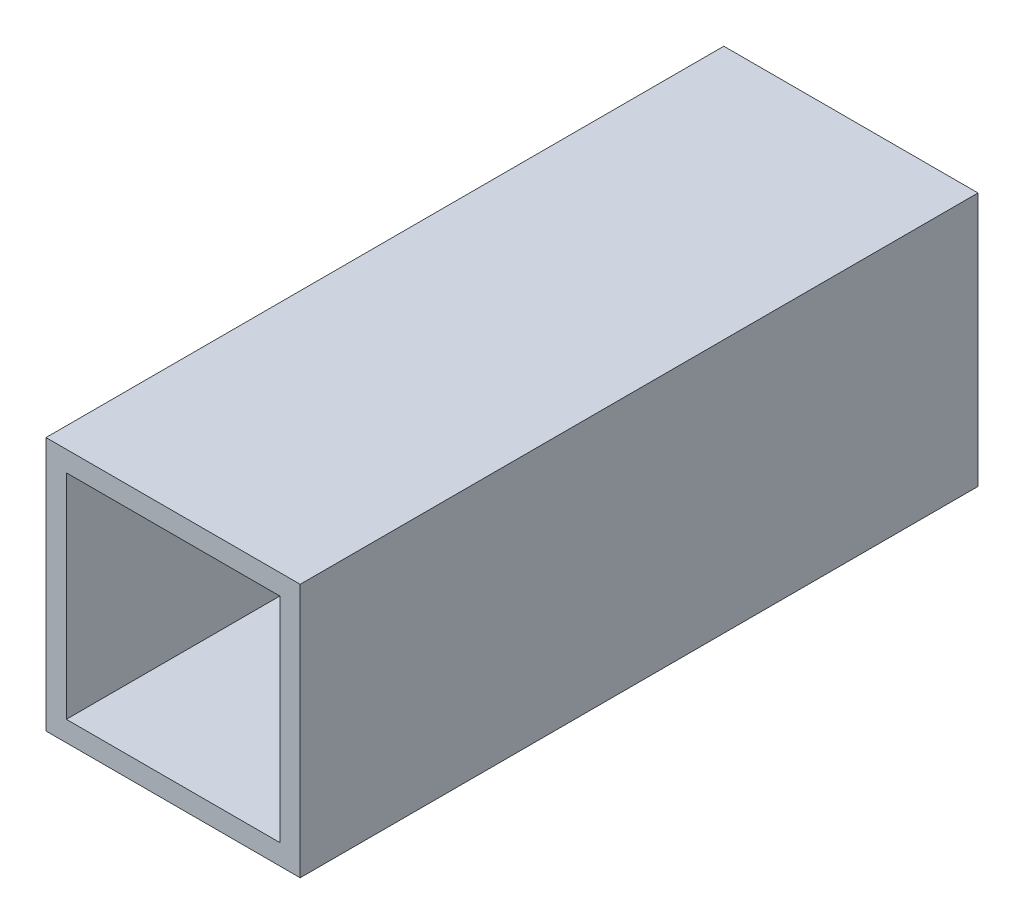
ISO-10303-21;
HEADER;
FILE_DESCRIPTION(('STEP AP214'),'2;1');
FILE_NAME('part.step','',(''),(''),'','','');
FILE_SCHEMA(('AUTOMOTIVE_DESIGN { 1 0 10303 214 1 1 1 1 }'));
ENDSEC;
DATA;
#1=APPLICATION_CONTEXT('core data for automotive mechanical design processes');
#2=APPLICATION_PROTOCOL_DEFINITION('international standard','automotive_design',2000,#1);
#3=PRODUCT_CONTEXT('',#1,'mechanical');
#4=PRODUCT('Part','Part','',(#3));
#5=PRODUCT_RELATED_PRODUCT_CATEGORY('part','',(#4));
#6=PRODUCT_DEFINITION_FORMATION('','',#4);
#7=PRODUCT_DEFINITION_CONTEXT('part definition',#1,'design');
#8=PRODUCT_DEFINITION('design','',#6,#7);
#9=PRODUCT_DEFINITION_SHAPE('','',#8);
#10=(LENGTH_UNIT() NAMED_UNIT(*) SI_UNIT(.MILLI.,.METRE.));
#11=(NAMED_UNIT(*) PLANE_ANGLE_UNIT() SI_UNIT($,.RADIAN.));
#12=(NAMED_UNIT(*) SI_UNIT($,.STERADIAN.) SOLID_ANGLE_UNIT());
#13=UNCERTAINTY_MEASURE_WITH_UNIT(LENGTH_MEASURE(1.E-05),#10,'distance_accuracy_value','');
#14=(GEOMETRIC_REPRESENTATION_CONTEXT(3) GLOBAL_UNCERTAINTY_ASSIGNED_CONTEXT((#13)) GLOBAL_UNIT_ASSIGNED_CONTEXT((#10,
#11,#12)) REPRESENTATION_CONTEXT('',''));
#15=CARTESIAN_POINT('',(0.,0.,0.));
#16=DIRECTION('',(0.,0.,1.));
#17=DIRECTION('',(1.,0.,0.));
#18=AXIS2_PLACEMENT_3D('',#15,#16,#17);
#19=CARTESIAN_POINT('',(0.,0.,50.8));
#20=DIRECTION('',(0.,0.,1.));
#21=DIRECTION('',(1.,0.,0.));
#22=AXIS2_PLACEMENT_3D('',#19,#20,#21);
#23=PLANE('',#22);
#24=DIRECTION('',(0.,-1.,0.));
#25=VECTOR('',#24,1.);
#26=CARTESIAN_POINT('',(-19.05,-19.05,50.8));
#27=LINE('',#26,#25);
#28=CARTESIAN_POINT('',(-19.05,19.05,50.8));
#29=VERTEX_POINT('',#28);
#30=CARTESIAN_POINT('',(-19.05,-19.05,50.8));
#31=VERTEX_POINT('',#30);
#32=EDGE_CURVE('E134',#29,#31,#27,.T.);
#33=ORIENTED_EDGE('',*,*,#32,.T.);
#34=DIRECTION('',(1.,0.,0.));
#35=VECTOR('',#34,1.);
#36=CARTESIAN_POINT('',(19.05,-19.05,50.8));
#37=LINE('',#36,#35);
#38=CARTESIAN_POINT('',(19.05,-19.05,50.8));
#39=VERTEX_POINT('',#38);
#40=EDGE_CURVE('E137',#31,#39,#37,.T.);
#41=ORIENTED_EDGE('',*,*,#40,.T.);
#42=DIRECTION('',(0.,1.,0.));
#43=VECTOR('',#42,1.);
#44=CARTESIAN_POINT('',(19.05,-19.05,50.8));
#45=LINE('',#44,#43);
#46=CARTESIAN_POINT('',(19.05,19.05,50.8));
#47=VERTEX_POINT('',#46);
#48=EDGE_CURVE('E140',#39,#47,#45,.T.);
#49=ORIENTED_EDGE('',*,*,#48,.T.);
#50=DIRECTION('',(-1.,0.,0.));
#51=VECTOR('',#50,1.);
#52=CARTESIAN_POINT('',(19.05,19.05,50.8));
#53=LINE('',#52,#51);
#54=EDGE_CURVE('E142',#47,#29,#53,.T.);
#55=ORIENTED_EDGE('',*,*,#54,.T.);
#56=EDGE_LOOP('',(#33,#41,#49,#55));
#57=FACE_BOUND('',#56,.T.);
#58=DIRECTION('',(-1.,0.,0.));
#59=VECTOR('',#58,1.);
#60=CARTESIAN_POINT('',(-16.002,16.002,50.8));
#61=LINE('',#60,#59);
#62=CARTESIAN_POINT('',(16.002,16.002,50.8));
#63=VERTEX_POINT('',#62);
#64=CARTESIAN_POINT('',(-16.002,16.002,50.8));
#65=VERTEX_POINT('',#64);
#66=EDGE_CURVE('E106',#63,#65,#61,.T.);
#67=ORIENTED_EDGE('',*,*,#66,.F.);
#68=DIRECTION('',(0.,1.,0.));
#69=VECTOR('',#68,1.);
#70=CARTESIAN_POINT('',(16.002,16.002,50.8));
#71=LINE('',#70,#69);
#72=CARTESIAN_POINT('',(16.002,-16.002,50.8));
#73=VERTEX_POINT('',#72);
#74=EDGE_CURVE('E98',#73,#63,#71,.T.);
#75=ORIENTED_EDGE('',*,*,#74,.F.);
#76=DIRECTION('',(1.,0.,0.));
#77=VECTOR('',#76,1.);
#78=CARTESIAN_POINT('',(-16.002,-16.002,50.8));
#79=LINE('',#78,#77);
#80=CARTESIAN_POINT('',(-16.002,-16.002,50.8));
#81=VERTEX_POINT('',#80);
#82=EDGE_CURVE('E120',#81,#73,#79,.T.);
#83=ORIENTED_EDGE('',*,*,#82,.F.);
#84=DIRECTION('',(0.,-1.,0.));
#85=VECTOR('',#84,1.);
#86=CARTESIAN_POINT('',(-16.002,16.002,50.8));
#87=LINE('',#86,#85);
#88=EDGE_CURVE('E118',#65,#81,#87,.T.);
#89=ORIENTED_EDGE('',*,*,#88,.F.);
#90=EDGE_LOOP('',(#67,#75,#83,#89));
#91=FACE_BOUND('',#90,.T.);
#92=ADVANCED_FACE('F33',(#57,#91),#23,.T.);
#93=CARTESIAN_POINT('',(0.,0.,-50.8));
#94=DIRECTION('',(0.,0.,1.));
#95=DIRECTION('',(1.,0.,0.));
#96=AXIS2_PLACEMENT_3D('',#93,#94,#95);
#97=PLANE('',#96);
#98=DIRECTION('',(0.,-1.,0.));
#99=VECTOR('',#98,1.);
#100=CARTESIAN_POINT('',(-19.05,-19.05,-50.8));
#101=LINE('',#100,#99);
#102=CARTESIAN_POINT('',(-19.05,19.05,-50.8));
#103=VERTEX_POINT('',#102);
#104=CARTESIAN_POINT('',(-19.05,-19.05,-50.8));
#105=VERTEX_POINT('',#104);
#106=EDGE_CURVE('E114',#103,#105,#101,.T.);
#107=ORIENTED_EDGE('',*,*,#106,.F.);
#108=DIRECTION('',(-1.,0.,0.));
#109=VECTOR('',#108,1.);
#110=CARTESIAN_POINT('',(19.05,19.05,-50.8));
#111=LINE('',#110,#109);
#112=CARTESIAN_POINT('',(19.05,19.05,-50.8));
#113=VERTEX_POINT('',#112);
#114=EDGE_CURVE('E138',#113,#103,#111,.T.);
#115=ORIENTED_EDGE('',*,*,#114,.F.);
#116=DIRECTION('',(0.,1.,0.));
#117=VECTOR('',#116,1.);
#118=CARTESIAN_POINT('',(19.05,-19.05,-50.8));
#119=LINE('',#118,#117);
#120=CARTESIAN_POINT('',(19.05,-19.05,-50.8));
#121=VERTEX_POINT('',#120);
#122=EDGE_CURVE('E149',#121,#113,#119,.T.);
#123=ORIENTED_EDGE('',*,*,#122,.F.);
#124=DIRECTION('',(1.,0.,0.));
#125=VECTOR('',#124,1.);
#126=CARTESIAN_POINT('',(19.05,-19.05,-50.8));
#127=LINE('',#126,#125);
#128=EDGE_CURVE('E147',#105,#121,#127,.T.);
#129=ORIENTED_EDGE('',*,*,#128,.F.);
#130=EDGE_LOOP('',(#107,#115,#123,#129));
#131=FACE_BOUND('',#130,.T.);
#132=DIRECTION('',(0.,1.,0.));
#133=VECTOR('',#132,1.);
#134=CARTESIAN_POINT('',(16.002,16.002,-50.8));
#135=LINE('',#134,#133);
#136=CARTESIAN_POINT('',(16.002,-16.002,-50.8));
#137=VERTEX_POINT('',#136);
#138=CARTESIAN_POINT('',(16.002,16.002,-50.8));
#139=VERTEX_POINT('',#138);
#140=EDGE_CURVE('E56',#137,#139,#135,.T.);
#141=ORIENTED_EDGE('',*,*,#140,.T.);
#142=DIRECTION('',(-1.,0.,0.));
#143=VECTOR('',#142,1.);
#144=CARTESIAN_POINT('',(-16.002,16.002,-50.8));
#145=LINE('',#144,#143);
#146=CARTESIAN_POINT('',(-16.002,16.002,-50.8));
#147=VERTEX_POINT('',#146);
#148=EDGE_CURVE('E113',#139,#147,#145,.T.);
#149=ORIENTED_EDGE('',*,*,#148,.T.);
#150=DIRECTION('',(0.,-1.,0.));
#151=VECTOR('',#150,1.);
#152=CARTESIAN_POINT('',(-16.002,16.002,-50.8));
#153=LINE('',#152,#151);
#154=CARTESIAN_POINT('',(-16.002,-16.002,-50.8));
#155=VERTEX_POINT('',#154);
#156=EDGE_CURVE('E126',#147,#155,#153,.T.);
#157=ORIENTED_EDGE('',*,*,#156,.T.);
#158=DIRECTION('',(1.,0.,0.));
#159=VECTOR('',#158,1.);
#160=CARTESIAN_POINT('',(-16.002,-16.002,-50.8));
#161=LINE('',#160,#159);
#162=EDGE_CURVE('E107',#155,#137,#161,.T.);
#163=ORIENTED_EDGE('',*,*,#162,.T.);
#164=EDGE_LOOP('',(#141,#149,#157,#163));
#165=FACE_BOUND('',#164,.T.);
#166=ADVANCED_FACE('F167',(#131,#165),#97,.F.);
#167=CARTESIAN_POINT('',(-19.05,-19.05,50.8));
#168=DIRECTION('',(1.,0.,0.));
#169=DIRECTION('',(0.,0.,-1.));
#170=AXIS2_PLACEMENT_3D('',#167,#168,#169);
#171=PLANE('',#170);
#172=ORIENTED_EDGE('',*,*,#106,.T.);
#173=DIRECTION('',(0.,0.,-1.));
#174=VECTOR('',#173,1.);
#175=CARTESIAN_POINT('',(-19.05,-19.05,50.8));
#176=LINE('',#175,#174);
#177=EDGE_CURVE('E11',#31,#105,#176,.T.);
#178=ORIENTED_EDGE('',*,*,#177,.F.);
#179=ORIENTED_EDGE('',*,*,#32,.F.);
#180=DIRECTION('',(0.,0.,-1.));
#181=VECTOR('',#180,1.);
#182=CARTESIAN_POINT('',(-19.05,19.05,50.8));
#183=LINE('',#182,#181);
#184=EDGE_CURVE('E144',#29,#103,#183,.T.);
#185=ORIENTED_EDGE('',*,*,#184,.T.);
#186=EDGE_LOOP('',(#172,#178,#179,#185));
#187=FACE_BOUND('',#186,.T.);
#188=ADVANCED_FACE('F35',(#187),#171,.F.);
#189=CARTESIAN_POINT('',(19.05,-19.05,50.8));
#190=DIRECTION('',(0.,1.,0.));
#191=DIRECTION('',(-1.,0.,0.));
#192=AXIS2_PLACEMENT_3D('',#189,#190,#191);
#193=PLANE('',#192);
#194=ORIENTED_EDGE('',*,*,#128,.T.);
#195=DIRECTION('',(0.,0.,-1.));
#196=VECTOR('',#195,1.);
#197=CARTESIAN_POINT('',(19.05,-19.05,50.8));
#198=LINE('',#197,#196);
#199=EDGE_CURVE('E41',#39,#121,#198,.T.);
#200=ORIENTED_EDGE('',*,*,#199,.F.);
#201=ORIENTED_EDGE('',*,*,#40,.F.);
#202=ORIENTED_EDGE('',*,*,#177,.T.);
#203=EDGE_LOOP('',(#194,#200,#201,#202));
#204=FACE_BOUND('',#203,.T.);
#205=ADVANCED_FACE('F177',(#204),#193,.F.);
#206=CARTESIAN_POINT('',(19.05,-19.05,50.8));
#207=DIRECTION('',(-1.,0.,0.));
#208=DIRECTION('',(0.,0.,1.));
#209=AXIS2_PLACEMENT_3D('',#206,#207,#208);
#210=PLANE('',#209);
#211=ORIENTED_EDGE('',*,*,#122,.T.);
#212=DIRECTION('',(0.,0.,-1.));
#213=VECTOR('',#212,1.);
#214=CARTESIAN_POINT('',(19.05,19.05,50.8));
#215=LINE('',#214,#213);
#216=EDGE_CURVE('E154',#47,#113,#215,.T.);
#217=ORIENTED_EDGE('',*,*,#216,.F.);
#218=ORIENTED_EDGE('',*,*,#48,.F.);
#219=ORIENTED_EDGE('',*,*,#199,.T.);
#220=EDGE_LOOP('',(#211,#217,#218,#219));
#221=FACE_BOUND('',#220,.T.);
#222=ADVANCED_FACE('F161',(#221),#210,.F.);
#223=CARTESIAN_POINT('',(19.05,19.05,50.8));
#224=DIRECTION('',(0.,-1.,0.));
#225=DIRECTION('',(1.,0.,0.));
#226=AXIS2_PLACEMENT_3D('',#223,#224,#225);
#227=PLANE('',#226);
#228=ORIENTED_EDGE('',*,*,#114,.T.);
#229=ORIENTED_EDGE('',*,*,#184,.F.);
#230=ORIENTED_EDGE('',*,*,#54,.F.);
#231=ORIENTED_EDGE('',*,*,#216,.T.);
#232=EDGE_LOOP('',(#228,#229,#230,#231));
#233=FACE_BOUND('',#232,.T.);
#234=ADVANCED_FACE('F171',(#233),#227,.F.);
#235=CARTESIAN_POINT('',(16.002,16.002,50.8));
#236=DIRECTION('',(-1.,0.,0.));
#237=DIRECTION('',(0.,-1.,0.));
#238=AXIS2_PLACEMENT_3D('',#235,#236,#237);
#239=PLANE('',#238);
#240=ORIENTED_EDGE('',*,*,#140,.F.);
#241=DIRECTION('',(0.,0.,-1.));
#242=VECTOR('',#241,1.);
#243=CARTESIAN_POINT('',(16.002,-16.002,50.8));
#244=LINE('',#243,#242);
#245=EDGE_CURVE('E102',#73,#137,#244,.T.);
#246=ORIENTED_EDGE('',*,*,#245,.F.);
#247=ORIENTED_EDGE('',*,*,#74,.T.);
#248=DIRECTION('',(0.,0.,-1.));
#249=VECTOR('',#248,1.);
#250=CARTESIAN_POINT('',(16.002,16.002,50.8));
#251=LINE('',#250,#249);
#252=EDGE_CURVE('E101',#63,#139,#251,.T.);
#253=ORIENTED_EDGE('',*,*,#252,.T.);
#254=EDGE_LOOP('',(#240,#246,#247,#253));
#255=FACE_BOUND('',#254,.T.);
#256=ADVANCED_FACE('F100',(#255),#239,.T.);
#257=CARTESIAN_POINT('',(-16.002,16.002,50.8));
#258=DIRECTION('',(0.,-1.,0.));
#259=DIRECTION('',(0.,0.,-1.));
#260=AXIS2_PLACEMENT_3D('',#257,#258,#259);
#261=PLANE('',#260);
#262=ORIENTED_EDGE('',*,*,#148,.F.);
#263=ORIENTED_EDGE('',*,*,#252,.F.);
#264=ORIENTED_EDGE('',*,*,#66,.T.);
#265=DIRECTION('',(0.,0.,-1.));
#266=VECTOR('',#265,1.);
#267=CARTESIAN_POINT('',(-16.002,16.002,50.8));
#268=LINE('',#267,#266);
#269=EDGE_CURVE('E115',#65,#147,#268,.T.);
#270=ORIENTED_EDGE('',*,*,#269,.T.);
#271=EDGE_LOOP('',(#262,#263,#264,#270));
#272=FACE_BOUND('',#271,.T.);
#273=ADVANCED_FACE('F110',(#272),#261,.T.);
#274=CARTESIAN_POINT('',(-16.002,16.002,50.8));
#275=DIRECTION('',(1.,0.,0.));
#276=DIRECTION('',(0.,0.,-1.));
#277=AXIS2_PLACEMENT_3D('',#274,#275,#276);
#278=PLANE('',#277);
#279=ORIENTED_EDGE('',*,*,#156,.F.);
#280=ORIENTED_EDGE('',*,*,#269,.F.);
#281=ORIENTED_EDGE('',*,*,#88,.T.);
#282=DIRECTION('',(0.,0.,-1.));
#283=VECTOR('',#282,1.);
#284=CARTESIAN_POINT('',(-16.002,-16.002,50.8));
#285=LINE('',#284,#283);
#286=EDGE_CURVE('E48',#81,#155,#285,.T.);
#287=ORIENTED_EDGE('',*,*,#286,.T.);
#288=EDGE_LOOP('',(#279,#280,#281,#287));
#289=FACE_BOUND('',#288,.T.);
#290=ADVANCED_FACE('F200',(#289),#278,.T.);
#291=CARTESIAN_POINT('',(-16.002,-16.002,50.8));
#292=DIRECTION('',(0.,1.,0.));
#293=DIRECTION('',(0.,0.,1.));
#294=AXIS2_PLACEMENT_3D('',#291,#292,#293);
#295=PLANE('',#294);
#296=ORIENTED_EDGE('',*,*,#162,.F.);
#297=ORIENTED_EDGE('',*,*,#286,.F.);
#298=ORIENTED_EDGE('',*,*,#82,.T.);
#299=ORIENTED_EDGE('',*,*,#245,.T.);
#300=EDGE_LOOP('',(#296,#297,#298,#299));
#301=FACE_BOUND('',#300,.T.);
#302=ADVANCED_FACE('F204',(#301),#295,.T.);
#303=CLOSED_SHELL('',(#92,#166,#188,#205,#222,#234,#256,#273,#290,#302));
#304=MANIFOLD_SOLID_BREP('B2',#303);
#305=ADVANCED_BREP_SHAPE_REPRESENTATION('',(#18,#304),#14);
#306=SHAPE_DEFINITION_REPRESENTATION(#9,#305);
ENDSEC;
END-ISO-10303-21;
